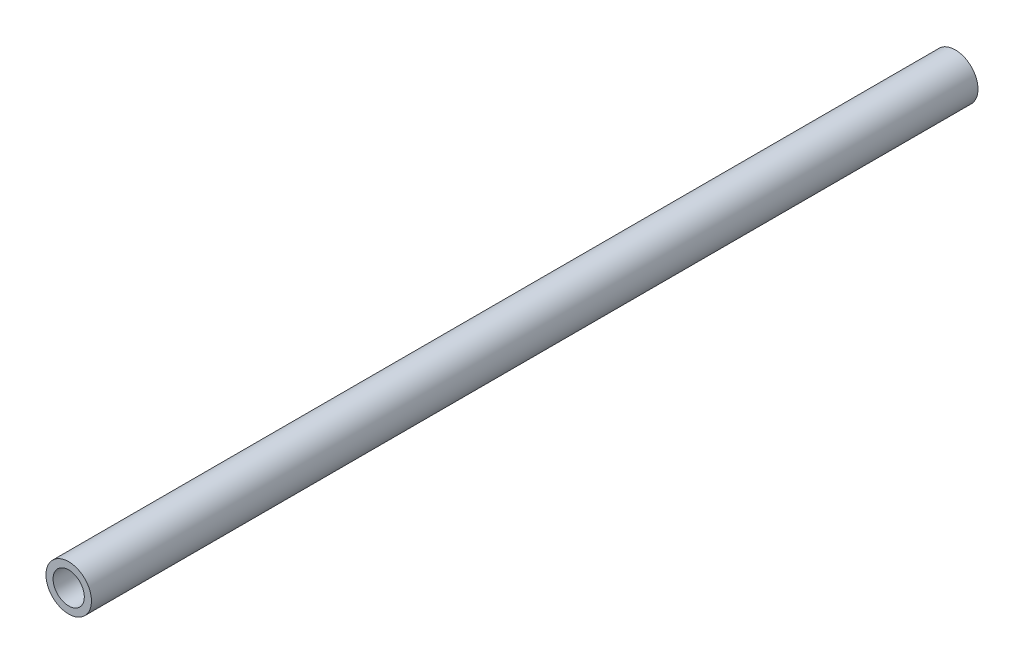
ISO-10303-21;
HEADER;
FILE_DESCRIPTION(('STEP AP214'),'2;1');
FILE_NAME('part.step','',(''),(''),'','','');
FILE_SCHEMA(('AUTOMOTIVE_DESIGN { 1 0 10303 214 1 1 1 1 }'));
ENDSEC;
DATA;
#1=APPLICATION_CONTEXT('core data for automotive mechanical design processes');
#2=APPLICATION_PROTOCOL_DEFINITION('international standard','automotive_design',2000,#1);
#3=PRODUCT_CONTEXT('',#1,'mechanical');
#4=PRODUCT('Part','Part','',(#3));
#5=PRODUCT_RELATED_PRODUCT_CATEGORY('part','',(#4));
#6=PRODUCT_DEFINITION_FORMATION('','',#4);
#7=PRODUCT_DEFINITION_CONTEXT('part definition',#1,'design');
#8=PRODUCT_DEFINITION('design','',#6,#7);
#9=PRODUCT_DEFINITION_SHAPE('','',#8);
#10=(LENGTH_UNIT() NAMED_UNIT(*) SI_UNIT(.MILLI.,.METRE.));
#11=(NAMED_UNIT(*) PLANE_ANGLE_UNIT() SI_UNIT($,.RADIAN.));
#12=(NAMED_UNIT(*) SI_UNIT($,.STERADIAN.) SOLID_ANGLE_UNIT());
#13=UNCERTAINTY_MEASURE_WITH_UNIT(LENGTH_MEASURE(1.E-05),#10,'distance_accuracy_value','');
#14=(GEOMETRIC_REPRESENTATION_CONTEXT(3) GLOBAL_UNCERTAINTY_ASSIGNED_CONTEXT((#13)) GLOBAL_UNIT_ASSIGNED_CONTEXT((#10,
#11,#12)) REPRESENTATION_CONTEXT('',''));
#15=CARTESIAN_POINT('',(0.,0.,0.));
#16=DIRECTION('',(0.,0.,1.));
#17=DIRECTION('',(1.,0.,0.));
#18=AXIS2_PLACEMENT_3D('',#15,#16,#17);
#19=CARTESIAN_POINT('',(0.,0.,495.3));
#20=DIRECTION('',(0.,0.,1.));
#21=DIRECTION('',(1.,0.,0.));
#22=AXIS2_PLACEMENT_3D('',#19,#20,#21);
#23=PLANE('',#22);
#24=CARTESIAN_POINT('',(0.,0.,495.3));
#25=DIRECTION('',(0.,0.,1.));
#26=DIRECTION('',(1.,0.,0.));
#27=AXIS2_PLACEMENT_3D('',#24,#25,#26);
#28=CIRCLE('',#27,12.7);
#29=CARTESIAN_POINT('',(12.7,0.,495.3));
#30=VERTEX_POINT('',#29);
#31=EDGE_CURVE('E12',#30,#30,#28,.T.);
#32=ORIENTED_EDGE('',*,*,#31,.T.);
#33=EDGE_LOOP('',(#32));
#34=FACE_BOUND('',#33,.T.);
#35=CARTESIAN_POINT('',(0.,0.,495.3));
#36=DIRECTION('',(0.,0.,1.));
#37=DIRECTION('',(1.,0.,0.));
#38=AXIS2_PLACEMENT_3D('',#35,#36,#37);
#39=CIRCLE('',#38,8.73125);
#40=CARTESIAN_POINT('',(8.73125,0.,495.3));
#41=VERTEX_POINT('',#40);
#42=EDGE_CURVE('E55',#41,#41,#39,.T.);
#43=ORIENTED_EDGE('',*,*,#42,.F.);
#44=EDGE_LOOP('',(#43));
#45=FACE_BOUND('',#44,.T.);
#46=ADVANCED_FACE('F44',(#34,#45),#23,.T.);
#47=CARTESIAN_POINT('',(0.,0.,0.));
#48=DIRECTION('',(0.,0.,1.));
#49=DIRECTION('',(1.,0.,0.));
#50=AXIS2_PLACEMENT_3D('',#47,#48,#49);
#51=PLANE('',#50);
#52=CARTESIAN_POINT('',(0.,0.,0.));
#53=DIRECTION('',(0.,0.,1.));
#54=DIRECTION('',(1.,0.,0.));
#55=AXIS2_PLACEMENT_3D('',#52,#53,#54);
#56=CIRCLE('',#55,12.7);
#57=CARTESIAN_POINT('',(12.7,0.,0.));
#58=VERTEX_POINT('',#57);
#59=EDGE_CURVE('E48',#58,#58,#56,.T.);
#60=ORIENTED_EDGE('',*,*,#59,.F.);
#61=EDGE_LOOP('',(#60));
#62=FACE_BOUND('',#61,.T.);
#63=CARTESIAN_POINT('',(0.,0.,0.));
#64=DIRECTION('',(0.,0.,1.));
#65=DIRECTION('',(1.,0.,0.));
#66=AXIS2_PLACEMENT_3D('',#63,#64,#65);
#67=CIRCLE('',#66,8.73125);
#68=CARTESIAN_POINT('',(8.73125,0.,0.));
#69=VERTEX_POINT('',#68);
#70=EDGE_CURVE('E57',#69,#69,#67,.T.);
#71=ORIENTED_EDGE('',*,*,#70,.T.);
#72=EDGE_LOOP('',(#71));
#73=FACE_BOUND('',#72,.T.);
#74=ADVANCED_FACE('F67',(#62,#73),#51,.F.);
#75=CARTESIAN_POINT('',(0.,0.,495.3));
#76=DIRECTION('',(0.,0.,-1.));
#77=DIRECTION('',(-1.,0.,0.));
#78=AXIS2_PLACEMENT_3D('',#75,#76,#77);
#79=CYLINDRICAL_SURFACE('',#78,12.7);
#80=ORIENTED_EDGE('',*,*,#31,.F.);
#81=EDGE_LOOP('',(#80));
#82=FACE_BOUND('',#81,.T.);
#83=ORIENTED_EDGE('',*,*,#59,.T.);
#84=EDGE_LOOP('',(#83));
#85=FACE_BOUND('',#84,.T.);
#86=ADVANCED_FACE('F46',(#82,#85),#79,.T.);
#87=CARTESIAN_POINT('',(0.,0.,495.3));
#88=DIRECTION('',(0.,0.,-1.));
#89=DIRECTION('',(-1.,0.,0.));
#90=AXIS2_PLACEMENT_3D('',#87,#88,#89);
#91=CYLINDRICAL_SURFACE('',#90,8.73125);
#92=ORIENTED_EDGE('',*,*,#42,.T.);
#93=EDGE_LOOP('',(#92));
#94=FACE_BOUND('',#93,.T.);
#95=ORIENTED_EDGE('',*,*,#70,.F.);
#96=EDGE_LOOP('',(#95));
#97=FACE_BOUND('',#96,.T.);
#98=ADVANCED_FACE('F63',(#94,#97),#91,.F.);
#99=CLOSED_SHELL('',(#46,#74,#86,#98));
#100=MANIFOLD_SOLID_BREP('B2',#99);
#101=ADVANCED_BREP_SHAPE_REPRESENTATION('',(#18,#100),#14);
#102=SHAPE_DEFINITION_REPRESENTATION(#9,#101);
ENDSEC;
END-ISO-10303-21;
